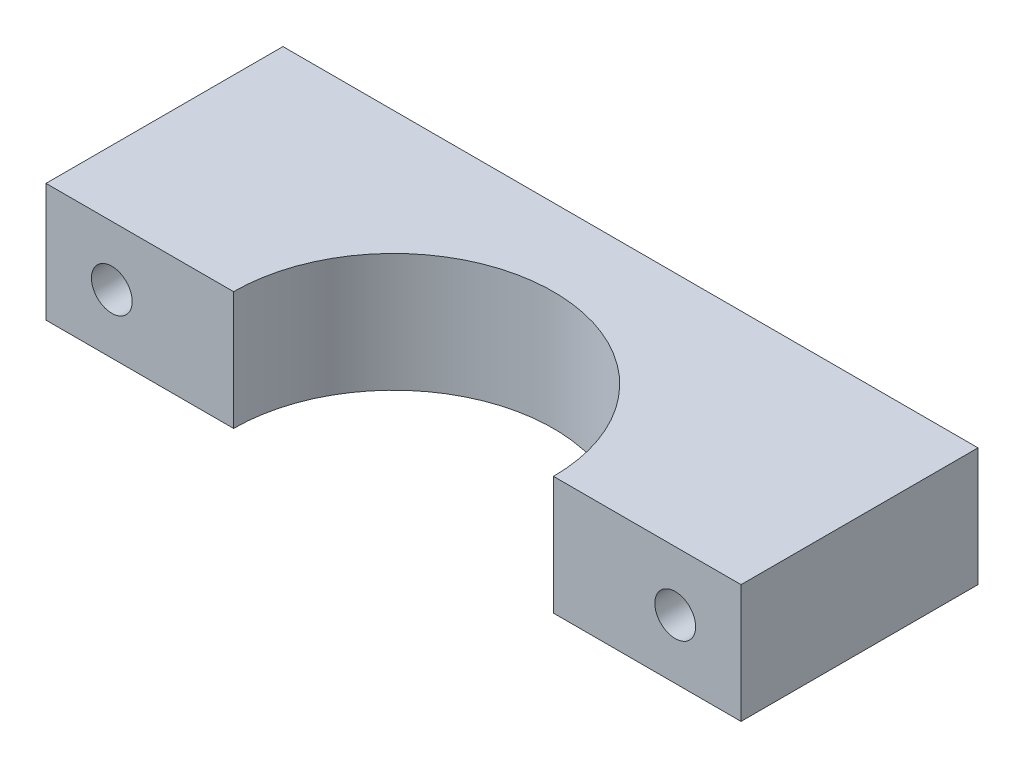
ISO-10303-21;
HEADER;
FILE_DESCRIPTION(('STEP AP214'),'2;1');
FILE_NAME('part.step','',(''),(''),'','','');
FILE_SCHEMA(('AUTOMOTIVE_DESIGN { 1 0 10303 214 1 1 1 1 }'));
ENDSEC;
DATA;
#1=APPLICATION_CONTEXT('core data for automotive mechanical design processes');
#2=APPLICATION_PROTOCOL_DEFINITION('international standard','automotive_design',2000,#1);
#3=PRODUCT_CONTEXT('',#1,'mechanical');
#4=PRODUCT('Part','Part','',(#3));
#5=PRODUCT_RELATED_PRODUCT_CATEGORY('part','',(#4));
#6=PRODUCT_DEFINITION_FORMATION('','',#4);
#7=PRODUCT_DEFINITION_CONTEXT('part definition',#1,'design');
#8=PRODUCT_DEFINITION('design','',#6,#7);
#9=PRODUCT_DEFINITION_SHAPE('','',#8);
#10=(LENGTH_UNIT() NAMED_UNIT(*) SI_UNIT(.MILLI.,.METRE.));
#11=(NAMED_UNIT(*) PLANE_ANGLE_UNIT() SI_UNIT($,.RADIAN.));
#12=(NAMED_UNIT(*) SI_UNIT($,.STERADIAN.) SOLID_ANGLE_UNIT());
#13=UNCERTAINTY_MEASURE_WITH_UNIT(LENGTH_MEASURE(1.E-05),#10,'distance_accuracy_value','');
#14=(GEOMETRIC_REPRESENTATION_CONTEXT(3) GLOBAL_UNCERTAINTY_ASSIGNED_CONTEXT((#13)) GLOBAL_UNIT_ASSIGNED_CONTEXT((#10,
#11,#12)) REPRESENTATION_CONTEXT('',''));
#15=CARTESIAN_POINT('',(0.,0.,0.));
#16=DIRECTION('',(0.,0.,1.));
#17=DIRECTION('',(1.,0.,0.));
#18=AXIS2_PLACEMENT_3D('',#15,#16,#17);
#19=CARTESIAN_POINT('',(0.,9.,0.));
#20=DIRECTION('',(0.,-1.,0.));
#21=DIRECTION('',(0.,0.,-1.));
#22=AXIS2_PLACEMENT_3D('',#19,#20,#21);
#23=CYLINDRICAL_SURFACE('',#22,12.15);
#24=CARTESIAN_POINT('',(0.,0.,0.));
#25=DIRECTION('',(0.,-1.,0.));
#26=DIRECTION('',(0.,0.,1.));
#27=AXIS2_PLACEMENT_3D('',#24,#25,#26);
#28=CIRCLE('',#27,12.15);
#29=CARTESIAN_POINT('',(-12.15,0.,0.));
#30=VERTEX_POINT('',#29);
#31=CARTESIAN_POINT('',(12.15,0.,0.));
#32=VERTEX_POINT('',#31);
#33=EDGE_CURVE('E120',#30,#32,#28,.T.);
#34=ORIENTED_EDGE('',*,*,#33,.T.);
#35=DIRECTION('',(0.,-1.,0.));
#36=VECTOR('',#35,1.);
#37=CARTESIAN_POINT('',(12.15,9.,0.));
#38=LINE('',#37,#36);
#39=CARTESIAN_POINT('',(12.15,9.,0.));
#40=VERTEX_POINT('',#39);
#41=EDGE_CURVE('E11',#40,#32,#38,.T.);
#42=ORIENTED_EDGE('',*,*,#41,.F.);
#43=CARTESIAN_POINT('',(0.,9.,0.));
#44=DIRECTION('',(0.,-1.,0.));
#45=DIRECTION('',(0.,0.,1.));
#46=AXIS2_PLACEMENT_3D('',#43,#44,#45);
#47=CIRCLE('',#46,12.15);
#48=CARTESIAN_POINT('',(-12.15,9.,0.));
#49=VERTEX_POINT('',#48);
#50=EDGE_CURVE('E131',#49,#40,#47,.T.);
#51=ORIENTED_EDGE('',*,*,#50,.F.);
#52=DIRECTION('',(0.,-1.,0.));
#53=VECTOR('',#52,1.);
#54=CARTESIAN_POINT('',(-12.15,9.,0.));
#55=LINE('',#54,#53);
#56=EDGE_CURVE('E116',#49,#30,#55,.T.);
#57=ORIENTED_EDGE('',*,*,#56,.T.);
#58=EDGE_LOOP('',(#34,#42,#51,#57));
#59=FACE_BOUND('',#58,.T.);
#60=ADVANCED_FACE('F36',(#59),#23,.F.);
#61=CARTESIAN_POINT('',(12.15,9.,0.));
#62=DIRECTION('',(0.,0.,-1.));
#63=DIRECTION('',(-1.,0.,0.));
#64=AXIS2_PLACEMENT_3D('',#61,#62,#63);
#65=PLANE('',#64);
#66=CARTESIAN_POINT('',(21.4,4.5,0.));
#67=DIRECTION('',(0.,0.,1.));
#68=DIRECTION('',(1.,0.,0.));
#69=AXIS2_PLACEMENT_3D('',#66,#67,#68);
#70=CIRCLE('',#69,1.55);
#71=CARTESIAN_POINT('',(22.95,4.5,0.));
#72=VERTEX_POINT('',#71);
#73=EDGE_CURVE('E179',#72,#72,#70,.T.);
#74=ORIENTED_EDGE('',*,*,#73,.F.);
#75=EDGE_LOOP('',(#74));
#76=FACE_BOUND('',#75,.T.);
#77=DIRECTION('',(1.,0.,0.));
#78=VECTOR('',#77,1.);
#79=CARTESIAN_POINT('',(12.15,0.,0.));
#80=LINE('',#79,#78);
#81=CARTESIAN_POINT('',(26.4,0.,0.));
#82=VERTEX_POINT('',#81);
#83=EDGE_CURVE('E123',#32,#82,#80,.T.);
#84=ORIENTED_EDGE('',*,*,#83,.T.);
#85=DIRECTION('',(0.,-1.,0.));
#86=VECTOR('',#85,1.);
#87=CARTESIAN_POINT('',(26.4,9.,0.));
#88=LINE('',#87,#86);
#89=CARTESIAN_POINT('',(26.4,9.,0.));
#90=VERTEX_POINT('',#89);
#91=EDGE_CURVE('E44',#90,#82,#88,.T.);
#92=ORIENTED_EDGE('',*,*,#91,.F.);
#93=DIRECTION('',(1.,0.,0.));
#94=VECTOR('',#93,1.);
#95=CARTESIAN_POINT('',(12.15,9.,0.));
#96=LINE('',#95,#94);
#97=EDGE_CURVE('E89',#40,#90,#96,.T.);
#98=ORIENTED_EDGE('',*,*,#97,.F.);
#99=ORIENTED_EDGE('',*,*,#41,.T.);
#100=EDGE_LOOP('',(#84,#92,#98,#99));
#101=FACE_BOUND('',#100,.T.);
#102=ADVANCED_FACE('F157',(#76,#101),#65,.F.);
#103=CARTESIAN_POINT('',(26.4,9.,0.));
#104=DIRECTION('',(-1.,0.,0.));
#105=DIRECTION('',(0.,0.,1.));
#106=AXIS2_PLACEMENT_3D('',#103,#104,#105);
#107=PLANE('',#106);
#108=DIRECTION('',(0.,0.,-1.));
#109=VECTOR('',#108,1.);
#110=CARTESIAN_POINT('',(26.4,0.,0.));
#111=LINE('',#110,#109);
#112=CARTESIAN_POINT('',(26.4,0.,-18.));
#113=VERTEX_POINT('',#112);
#114=EDGE_CURVE('E126',#82,#113,#111,.T.);
#115=ORIENTED_EDGE('',*,*,#114,.T.);
#116=DIRECTION('',(0.,-1.,0.));
#117=VECTOR('',#116,1.);
#118=CARTESIAN_POINT('',(26.4,9.,-18.));
#119=LINE('',#118,#117);
#120=CARTESIAN_POINT('',(26.4,9.,-18.));
#121=VERTEX_POINT('',#120);
#122=EDGE_CURVE('E111',#121,#113,#119,.T.);
#123=ORIENTED_EDGE('',*,*,#122,.F.);
#124=DIRECTION('',(0.,0.,-1.));
#125=VECTOR('',#124,1.);
#126=CARTESIAN_POINT('',(26.4,9.,0.));
#127=LINE('',#126,#125);
#128=EDGE_CURVE('E102',#90,#121,#127,.T.);
#129=ORIENTED_EDGE('',*,*,#128,.F.);
#130=ORIENTED_EDGE('',*,*,#91,.T.);
#131=EDGE_LOOP('',(#115,#123,#129,#130));
#132=FACE_BOUND('',#131,.T.);
#133=ADVANCED_FACE('F137',(#132),#107,.F.);
#134=CARTESIAN_POINT('',(26.4,9.,-18.));
#135=DIRECTION('',(0.,0.,1.));
#136=DIRECTION('',(1.,0.,0.));
#137=AXIS2_PLACEMENT_3D('',#134,#135,#136);
#138=PLANE('',#137);
#139=CARTESIAN_POINT('',(-21.4,4.5,-18.));
#140=DIRECTION('',(0.,0.,-1.));
#141=DIRECTION('',(-1.,0.,0.));
#142=AXIS2_PLACEMENT_3D('',#139,#140,#141);
#143=CIRCLE('',#142,1.55);
#144=CARTESIAN_POINT('',(-22.95,4.5,-18.));
#145=VERTEX_POINT('',#144);
#146=EDGE_CURVE('E175',#145,#145,#143,.T.);
#147=ORIENTED_EDGE('',*,*,#146,.F.);
#148=EDGE_LOOP('',(#147));
#149=FACE_BOUND('',#148,.T.);
#150=CARTESIAN_POINT('',(21.4,4.5,-18.));
#151=DIRECTION('',(0.,0.,1.));
#152=DIRECTION('',(1.,0.,0.));
#153=AXIS2_PLACEMENT_3D('',#150,#151,#152);
#154=CIRCLE('',#153,1.55);
#155=CARTESIAN_POINT('',(22.95,4.5,-18.));
#156=VERTEX_POINT('',#155);
#157=EDGE_CURVE('E124',#156,#156,#154,.T.);
#158=ORIENTED_EDGE('',*,*,#157,.T.);
#159=EDGE_LOOP('',(#158));
#160=FACE_BOUND('',#159,.T.);
#161=DIRECTION('',(-1.,0.,0.));
#162=VECTOR('',#161,1.);
#163=CARTESIAN_POINT('',(26.4,0.,-18.));
#164=LINE('',#163,#162);
#165=CARTESIAN_POINT('',(-26.4,0.,-18.));
#166=VERTEX_POINT('',#165);
#167=EDGE_CURVE('E110',#113,#166,#164,.T.);
#168=ORIENTED_EDGE('',*,*,#167,.T.);
#169=DIRECTION('',(0.,-1.,0.));
#170=VECTOR('',#169,1.);
#171=CARTESIAN_POINT('',(-26.4,9.,-18.));
#172=LINE('',#171,#170);
#173=CARTESIAN_POINT('',(-26.4,9.,-18.));
#174=VERTEX_POINT('',#173);
#175=EDGE_CURVE('E107',#174,#166,#172,.T.);
#176=ORIENTED_EDGE('',*,*,#175,.F.);
#177=DIRECTION('',(-1.,0.,0.));
#178=VECTOR('',#177,1.);
#179=CARTESIAN_POINT('',(26.4,9.,-18.));
#180=LINE('',#179,#178);
#181=EDGE_CURVE('E96',#121,#174,#180,.T.);
#182=ORIENTED_EDGE('',*,*,#181,.F.);
#183=ORIENTED_EDGE('',*,*,#122,.T.);
#184=EDGE_LOOP('',(#168,#176,#182,#183));
#185=FACE_BOUND('',#184,.T.);
#186=ADVANCED_FACE('F108',(#149,#160,#185),#138,.F.);
#187=CARTESIAN_POINT('',(-26.4,9.,0.));
#188=DIRECTION('',(1.,0.,0.));
#189=DIRECTION('',(0.,0.,-1.));
#190=AXIS2_PLACEMENT_3D('',#187,#188,#189);
#191=PLANE('',#190);
#192=DIRECTION('',(0.,0.,1.));
#193=VECTOR('',#192,1.);
#194=CARTESIAN_POINT('',(-26.4,0.,0.));
#195=LINE('',#194,#193);
#196=CARTESIAN_POINT('',(-26.4,0.,0.));
#197=VERTEX_POINT('',#196);
#198=EDGE_CURVE('E75',#166,#197,#195,.T.);
#199=ORIENTED_EDGE('',*,*,#198,.T.);
#200=DIRECTION('',(0.,-1.,0.));
#201=VECTOR('',#200,1.);
#202=CARTESIAN_POINT('',(-26.4,9.,0.));
#203=LINE('',#202,#201);
#204=CARTESIAN_POINT('',(-26.4,9.,0.));
#205=VERTEX_POINT('',#204);
#206=EDGE_CURVE('E112',#205,#197,#203,.T.);
#207=ORIENTED_EDGE('',*,*,#206,.F.);
#208=DIRECTION('',(0.,0.,1.));
#209=VECTOR('',#208,1.);
#210=CARTESIAN_POINT('',(-26.4,9.,0.));
#211=LINE('',#210,#209);
#212=EDGE_CURVE('E100',#174,#205,#211,.T.);
#213=ORIENTED_EDGE('',*,*,#212,.F.);
#214=ORIENTED_EDGE('',*,*,#175,.T.);
#215=EDGE_LOOP('',(#199,#207,#213,#214));
#216=FACE_BOUND('',#215,.T.);
#217=ADVANCED_FACE('F114',(#216),#191,.F.);
#218=CARTESIAN_POINT('',(-12.15,9.,0.));
#219=DIRECTION('',(0.,0.,-1.));
#220=DIRECTION('',(-1.,0.,0.));
#221=AXIS2_PLACEMENT_3D('',#218,#219,#220);
#222=PLANE('',#221);
#223=CARTESIAN_POINT('',(-21.4,4.5,0.));
#224=DIRECTION('',(0.,0.,-1.));
#225=DIRECTION('',(-1.,0.,0.));
#226=AXIS2_PLACEMENT_3D('',#223,#224,#225);
#227=CIRCLE('',#226,1.55);
#228=CARTESIAN_POINT('',(-22.95,4.5,0.));
#229=VERTEX_POINT('',#228);
#230=EDGE_CURVE('E184',#229,#229,#227,.T.);
#231=ORIENTED_EDGE('',*,*,#230,.T.);
#232=EDGE_LOOP('',(#231));
#233=FACE_BOUND('',#232,.T.);
#234=DIRECTION('',(1.,0.,0.));
#235=VECTOR('',#234,1.);
#236=CARTESIAN_POINT('',(-12.15,0.,0.));
#237=LINE('',#236,#235);
#238=EDGE_CURVE('E81',#197,#30,#237,.T.);
#239=ORIENTED_EDGE('',*,*,#238,.T.);
#240=ORIENTED_EDGE('',*,*,#56,.F.);
#241=DIRECTION('',(1.,0.,0.));
#242=VECTOR('',#241,1.);
#243=CARTESIAN_POINT('',(-12.15,9.,0.));
#244=LINE('',#243,#242);
#245=EDGE_CURVE('E52',#205,#49,#244,.T.);
#246=ORIENTED_EDGE('',*,*,#245,.F.);
#247=ORIENTED_EDGE('',*,*,#206,.T.);
#248=EDGE_LOOP('',(#239,#240,#246,#247));
#249=FACE_BOUND('',#248,.T.);
#250=ADVANCED_FACE('F144',(#233,#249),#222,.F.);
#251=CARTESIAN_POINT('',(0.,9.,0.));
#252=DIRECTION('',(0.,1.,0.));
#253=DIRECTION('',(0.,0.,1.));
#254=AXIS2_PLACEMENT_3D('',#251,#252,#253);
#255=PLANE('',#254);
#256=ORIENTED_EDGE('',*,*,#50,.T.);
#257=ORIENTED_EDGE('',*,*,#97,.T.);
#258=ORIENTED_EDGE('',*,*,#128,.T.);
#259=ORIENTED_EDGE('',*,*,#181,.T.);
#260=ORIENTED_EDGE('',*,*,#212,.T.);
#261=ORIENTED_EDGE('',*,*,#245,.T.);
#262=EDGE_LOOP('',(#256,#257,#258,#259,#260,#261));
#263=FACE_BOUND('',#262,.T.);
#264=ADVANCED_FACE('F98',(#263),#255,.T.);
#265=CARTESIAN_POINT('',(0.,0.,0.));
#266=DIRECTION('',(0.,1.,0.));
#267=DIRECTION('',(0.,0.,1.));
#268=AXIS2_PLACEMENT_3D('',#265,#266,#267);
#269=PLANE('',#268);
#270=ORIENTED_EDGE('',*,*,#33,.F.);
#271=ORIENTED_EDGE('',*,*,#238,.F.);
#272=ORIENTED_EDGE('',*,*,#198,.F.);
#273=ORIENTED_EDGE('',*,*,#167,.F.);
#274=ORIENTED_EDGE('',*,*,#114,.F.);
#275=ORIENTED_EDGE('',*,*,#83,.F.);
#276=EDGE_LOOP('',(#270,#271,#272,#273,#274,#275));
#277=FACE_BOUND('',#276,.T.);
#278=ADVANCED_FACE('F140',(#277),#269,.F.);
#279=CARTESIAN_POINT('',(21.4,4.5,-18.));
#280=DIRECTION('',(0.,0.,1.));
#281=DIRECTION('',(1.,0.,0.));
#282=AXIS2_PLACEMENT_3D('',#279,#280,#281);
#283=CYLINDRICAL_SURFACE('',#282,1.55);
#284=ORIENTED_EDGE('',*,*,#157,.F.);
#285=EDGE_LOOP('',(#284));
#286=FACE_BOUND('',#285,.T.);
#287=ORIENTED_EDGE('',*,*,#73,.T.);
#288=EDGE_LOOP('',(#287));
#289=FACE_BOUND('',#288,.T.);
#290=ADVANCED_FACE('F192',(#286,#289),#283,.F.);
#291=CARTESIAN_POINT('',(-21.4,4.5,-18.));
#292=DIRECTION('',(0.,0.,1.));
#293=DIRECTION('',(1.,0.,0.));
#294=AXIS2_PLACEMENT_3D('',#291,#292,#293);
#295=CYLINDRICAL_SURFACE('',#294,1.55);
#296=ORIENTED_EDGE('',*,*,#146,.T.);
#297=EDGE_LOOP('',(#296));
#298=FACE_BOUND('',#297,.T.);
#299=ORIENTED_EDGE('',*,*,#230,.F.);
#300=EDGE_LOOP('',(#299));
#301=FACE_BOUND('',#300,.T.);
#302=ADVANCED_FACE('F189',(#298,#301),#295,.F.);
#303=CLOSED_SHELL('',(#60,#102,#133,#186,#217,#250,#264,#278,#290,#302));
#304=MANIFOLD_SOLID_BREP('B2',#303);
#305=ADVANCED_BREP_SHAPE_REPRESENTATION('',(#18,#304),#14);
#306=SHAPE_DEFINITION_REPRESENTATION(#9,#305);
ENDSEC;
END-ISO-10303-21;
